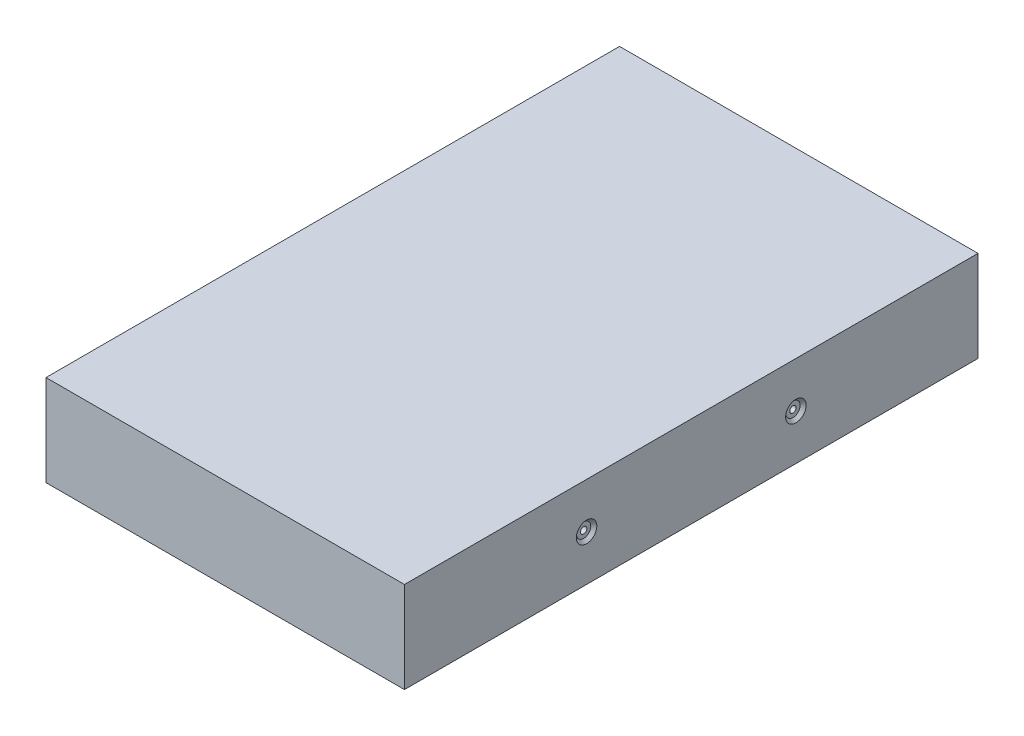
ISO-10303-21;
HEADER;
FILE_DESCRIPTION(('STEP AP214'),'2;1');
FILE_NAME('part.step','',(''),(''),'','','');
FILE_SCHEMA(('AUTOMOTIVE_DESIGN { 1 0 10303 214 1 1 1 1 }'));
ENDSEC;
DATA;
#1=APPLICATION_CONTEXT('core data for automotive mechanical design processes');
#2=APPLICATION_PROTOCOL_DEFINITION('international standard','automotive_design',2000,#1);
#3=PRODUCT_CONTEXT('',#1,'mechanical');
#4=PRODUCT('Part','Part','',(#3));
#5=PRODUCT_RELATED_PRODUCT_CATEGORY('part','',(#4));
#6=PRODUCT_DEFINITION_FORMATION('','',#4);
#7=PRODUCT_DEFINITION_CONTEXT('part definition',#1,'design');
#8=PRODUCT_DEFINITION('design','',#6,#7);
#9=PRODUCT_DEFINITION_SHAPE('','',#8);
#10=(LENGTH_UNIT() NAMED_UNIT(*) SI_UNIT(.MILLI.,.METRE.));
#11=(NAMED_UNIT(*) PLANE_ANGLE_UNIT() SI_UNIT($,.RADIAN.));
#12=(NAMED_UNIT(*) SI_UNIT($,.STERADIAN.) SOLID_ANGLE_UNIT());
#13=UNCERTAINTY_MEASURE_WITH_UNIT(LENGTH_MEASURE(1.E-05),#10,'distance_accuracy_value','');
#14=(GEOMETRIC_REPRESENTATION_CONTEXT(3) GLOBAL_UNCERTAINTY_ASSIGNED_CONTEXT((#13)) GLOBAL_UNIT_ASSIGNED_CONTEXT((#10,
#11,#12)) REPRESENTATION_CONTEXT('',''));
#15=CARTESIAN_POINT('',(0.,0.,0.));
#16=DIRECTION('',(0.,0.,1.));
#17=DIRECTION('',(1.,0.,0.));
#18=AXIS2_PLACEMENT_3D('',#15,#16,#17);
#19=CARTESIAN_POINT('',(50.,25.4,-80.));
#20=DIRECTION('',(-1.,0.,0.));
#21=DIRECTION('',(0.,0.,1.));
#22=AXIS2_PLACEMENT_3D('',#19,#20,#21);
#23=PLANE('',#22);
#24=CARTESIAN_POINT('',(50.,12.7,29.2));
#25=DIRECTION('',(1.,0.,0.));
#26=DIRECTION('',(0.,0.,-1.));
#27=AXIS2_PLACEMENT_3D('',#24,#25,#26);
#28=CIRCLE('',#27,2.8575);
#29=CARTESIAN_POINT('',(50.,12.7,26.3425));
#30=VERTEX_POINT('',#29);
#31=EDGE_CURVE('E163',#30,#30,#28,.T.);
#32=ORIENTED_EDGE('',*,*,#31,.F.);
#33=EDGE_LOOP('',(#32));
#34=FACE_BOUND('',#33,.T.);
#35=CARTESIAN_POINT('',(50.,12.7,-29.2));
#36=DIRECTION('',(1.,0.,0.));
#37=DIRECTION('',(0.,0.,-1.));
#38=AXIS2_PLACEMENT_3D('',#35,#36,#37);
#39=CIRCLE('',#38,2.8575);
#40=CARTESIAN_POINT('',(50.,12.7,-32.0575));
#41=VERTEX_POINT('',#40);
#42=EDGE_CURVE('E97',#41,#41,#39,.T.);
#43=ORIENTED_EDGE('',*,*,#42,.F.);
#44=EDGE_LOOP('',(#43));
#45=FACE_BOUND('',#44,.T.);
#46=DIRECTION('',(0.,0.,-1.));
#47=VECTOR('',#46,1.);
#48=CARTESIAN_POINT('',(50.,0.,-80.));
#49=LINE('',#48,#47);
#50=CARTESIAN_POINT('',(50.,0.,80.));
#51=VERTEX_POINT('',#50);
#52=CARTESIAN_POINT('',(50.,0.,-80.));
#53=VERTEX_POINT('',#52);
#54=EDGE_CURVE('E119',#51,#53,#49,.T.);
#55=ORIENTED_EDGE('',*,*,#54,.T.);
#56=DIRECTION('',(0.,-1.,0.));
#57=VECTOR('',#56,1.);
#58=CARTESIAN_POINT('',(50.,25.4,-80.));
#59=LINE('',#58,#57);
#60=CARTESIAN_POINT('',(50.,25.4,-80.));
#61=VERTEX_POINT('',#60);
#62=EDGE_CURVE('E11',#61,#53,#59,.T.);
#63=ORIENTED_EDGE('',*,*,#62,.F.);
#64=DIRECTION('',(0.,0.,-1.));
#65=VECTOR('',#64,1.);
#66=CARTESIAN_POINT('',(50.,25.4,-80.));
#67=LINE('',#66,#65);
#68=CARTESIAN_POINT('',(50.,25.4,80.));
#69=VERTEX_POINT('',#68);
#70=EDGE_CURVE('E120',#69,#61,#67,.T.);
#71=ORIENTED_EDGE('',*,*,#70,.F.);
#72=DIRECTION('',(0.,-1.,0.));
#73=VECTOR('',#72,1.);
#74=CARTESIAN_POINT('',(50.,25.4,80.));
#75=LINE('',#74,#73);
#76=EDGE_CURVE('E126',#69,#51,#75,.T.);
#77=ORIENTED_EDGE('',*,*,#76,.T.);
#78=EDGE_LOOP('',(#55,#63,#71,#77));
#79=FACE_BOUND('',#78,.T.);
#80=ADVANCED_FACE('F33',(#34,#45,#79),#23,.F.);
#81=CARTESIAN_POINT('',(-50.,25.4,-80.));
#82=DIRECTION('',(0.,0.,1.));
#83=DIRECTION('',(1.,0.,0.));
#84=AXIS2_PLACEMENT_3D('',#81,#82,#83);
#85=PLANE('',#84);
#86=DIRECTION('',(-1.,0.,0.));
#87=VECTOR('',#86,1.);
#88=CARTESIAN_POINT('',(-50.,0.,-80.));
#89=LINE('',#88,#87);
#90=CARTESIAN_POINT('',(-50.,0.,-80.));
#91=VERTEX_POINT('',#90);
#92=EDGE_CURVE('E129',#53,#91,#89,.T.);
#93=ORIENTED_EDGE('',*,*,#92,.T.);
#94=DIRECTION('',(0.,-1.,0.));
#95=VECTOR('',#94,1.);
#96=CARTESIAN_POINT('',(-50.,25.4,-80.));
#97=LINE('',#96,#95);
#98=CARTESIAN_POINT('',(-50.,25.4,-80.));
#99=VERTEX_POINT('',#98);
#100=EDGE_CURVE('E41',#99,#91,#97,.T.);
#101=ORIENTED_EDGE('',*,*,#100,.F.);
#102=DIRECTION('',(-1.,0.,0.));
#103=VECTOR('',#102,1.);
#104=CARTESIAN_POINT('',(-50.,25.4,-80.));
#105=LINE('',#104,#103);
#106=EDGE_CURVE('E80',#61,#99,#105,.T.);
#107=ORIENTED_EDGE('',*,*,#106,.F.);
#108=ORIENTED_EDGE('',*,*,#62,.T.);
#109=EDGE_LOOP('',(#93,#101,#107,#108));
#110=FACE_BOUND('',#109,.T.);
#111=ADVANCED_FACE('F152',(#110),#85,.F.);
#112=CARTESIAN_POINT('',(-50.,25.4,-80.));
#113=DIRECTION('',(1.,0.,0.));
#114=DIRECTION('',(0.,0.,-1.));
#115=AXIS2_PLACEMENT_3D('',#112,#113,#114);
#116=PLANE('',#115);
#117=DIRECTION('',(0.,0.,1.));
#118=VECTOR('',#117,1.);
#119=CARTESIAN_POINT('',(-50.,0.,-80.));
#120=LINE('',#119,#118);
#121=CARTESIAN_POINT('',(-50.,0.,80.));
#122=VERTEX_POINT('',#121);
#123=EDGE_CURVE('E67',#91,#122,#120,.T.);
#124=ORIENTED_EDGE('',*,*,#123,.T.);
#125=DIRECTION('',(0.,-1.,0.));
#126=VECTOR('',#125,1.);
#127=CARTESIAN_POINT('',(-50.,25.4,80.));
#128=LINE('',#127,#126);
#129=CARTESIAN_POINT('',(-50.,25.4,80.));
#130=VERTEX_POINT('',#129);
#131=EDGE_CURVE('E134',#130,#122,#128,.T.);
#132=ORIENTED_EDGE('',*,*,#131,.F.);
#133=DIRECTION('',(0.,0.,1.));
#134=VECTOR('',#133,1.);
#135=CARTESIAN_POINT('',(-50.,25.4,-80.));
#136=LINE('',#135,#134);
#137=EDGE_CURVE('E123',#99,#130,#136,.T.);
#138=ORIENTED_EDGE('',*,*,#137,.F.);
#139=ORIENTED_EDGE('',*,*,#100,.T.);
#140=EDGE_LOOP('',(#124,#132,#138,#139));
#141=FACE_BOUND('',#140,.T.);
#142=ADVANCED_FACE('F136',(#141),#116,.F.);
#143=CARTESIAN_POINT('',(-50.,25.4,80.));
#144=DIRECTION('',(0.,0.,-1.));
#145=DIRECTION('',(-1.,0.,0.));
#146=AXIS2_PLACEMENT_3D('',#143,#144,#145);
#147=PLANE('',#146);
#148=DIRECTION('',(1.,0.,0.));
#149=VECTOR('',#148,1.);
#150=CARTESIAN_POINT('',(-50.,0.,80.));
#151=LINE('',#150,#149);
#152=EDGE_CURVE('E73',#122,#51,#151,.T.);
#153=ORIENTED_EDGE('',*,*,#152,.T.);
#154=ORIENTED_EDGE('',*,*,#76,.F.);
#155=DIRECTION('',(1.,0.,0.));
#156=VECTOR('',#155,1.);
#157=CARTESIAN_POINT('',(-50.,25.4,80.));
#158=LINE('',#157,#156);
#159=EDGE_CURVE('E49',#130,#69,#158,.T.);
#160=ORIENTED_EDGE('',*,*,#159,.F.);
#161=ORIENTED_EDGE('',*,*,#131,.T.);
#162=EDGE_LOOP('',(#153,#154,#160,#161));
#163=FACE_BOUND('',#162,.T.);
#164=ADVANCED_FACE('F143',(#163),#147,.F.);
#165=CARTESIAN_POINT('',(0.,25.4,0.));
#166=DIRECTION('',(0.,1.,0.));
#167=DIRECTION('',(0.,0.,1.));
#168=AXIS2_PLACEMENT_3D('',#165,#166,#167);
#169=PLANE('',#168);
#170=ORIENTED_EDGE('',*,*,#70,.T.);
#171=ORIENTED_EDGE('',*,*,#106,.T.);
#172=ORIENTED_EDGE('',*,*,#137,.T.);
#173=ORIENTED_EDGE('',*,*,#159,.T.);
#174=EDGE_LOOP('',(#170,#171,#172,#173));
#175=FACE_BOUND('',#174,.T.);
#176=ADVANCED_FACE('F145',(#175),#169,.T.);
#177=CARTESIAN_POINT('',(0.,0.,0.));
#178=DIRECTION('',(0.,1.,0.));
#179=DIRECTION('',(0.,0.,1.));
#180=AXIS2_PLACEMENT_3D('',#177,#178,#179);
#181=PLANE('',#180);
#182=ORIENTED_EDGE('',*,*,#54,.F.);
#183=ORIENTED_EDGE('',*,*,#152,.F.);
#184=ORIENTED_EDGE('',*,*,#123,.F.);
#185=ORIENTED_EDGE('',*,*,#92,.F.);
#186=EDGE_LOOP('',(#182,#183,#184,#185));
#187=FACE_BOUND('',#186,.T.);
#188=ADVANCED_FACE('F139',(#187),#181,.F.);
#189=CARTESIAN_POINT('',(20.,12.7,-29.2));
#190=DIRECTION('',(1.,0.,0.));
#191=DIRECTION('',(0.,0.,-1.));
#192=AXIS2_PLACEMENT_3D('',#189,#190,#191);
#193=CONICAL_SURFACE('',#192,0.888999999999992,1.02974425867665);
#194=CARTESIAN_POINT('',(19.4658349096845,12.7,-29.2));
#195=VERTEX_POINT('',#194);
#196=VERTEX_LOOP('',#195);
#197=FACE_BOUND('',#196,.T.);
#198=CARTESIAN_POINT('',(20.,12.7,-29.2));
#199=DIRECTION('',(1.,0.,0.));
#200=DIRECTION('',(0.,0.,-1.));
#201=AXIS2_PLACEMENT_3D('',#198,#199,#200);
#202=CIRCLE('',#201,0.888999999999992);
#203=CARTESIAN_POINT('',(20.,12.7,-30.089));
#204=VERTEX_POINT('',#203);
#205=EDGE_CURVE('E116',#204,#204,#202,.T.);
#206=ORIENTED_EDGE('',*,*,#205,.T.);
#207=EDGE_LOOP('',(#206));
#208=FACE_BOUND('',#207,.T.);
#209=ADVANCED_FACE('F185',(#197,#208),#193,.F.);
#210=CARTESIAN_POINT('',(50.,12.7,-29.2));
#211=DIRECTION('',(1.,0.,0.));
#212=DIRECTION('',(0.,0.,-1.));
#213=AXIS2_PLACEMENT_3D('',#210,#211,#212);
#214=CYLINDRICAL_SURFACE('',#213,0.888999999999994);
#215=ORIENTED_EDGE('',*,*,#205,.F.);
#216=EDGE_LOOP('',(#215));
#217=FACE_BOUND('',#216,.T.);
#218=CARTESIAN_POINT('',(49.1872,12.7,-29.2));
#219=DIRECTION('',(1.,0.,0.));
#220=DIRECTION('',(0.,0.,-1.));
#221=AXIS2_PLACEMENT_3D('',#218,#219,#220);
#222=CIRCLE('',#221,0.888999999999996);
#223=CARTESIAN_POINT('',(49.1872,12.7,-30.089));
#224=VERTEX_POINT('',#223);
#225=EDGE_CURVE('E113',#224,#224,#222,.T.);
#226=ORIENTED_EDGE('',*,*,#225,.T.);
#227=EDGE_LOOP('',(#226));
#228=FACE_BOUND('',#227,.T.);
#229=ADVANCED_FACE('F181',(#217,#228),#214,.F.);
#230=CARTESIAN_POINT('',(49.1872,13.589,-29.2));
#231=DIRECTION('',(-1.,0.,0.));
#232=DIRECTION('',(0.,0.,1.));
#233=AXIS2_PLACEMENT_3D('',#230,#231,#232);
#234=PLANE('',#233);
#235=ORIENTED_EDGE('',*,*,#225,.F.);
#236=EDGE_LOOP('',(#235));
#237=FACE_BOUND('',#236,.T.);
#238=CARTESIAN_POINT('',(49.1872,12.7,-29.2));
#239=DIRECTION('',(1.,0.,0.));
#240=DIRECTION('',(0.,0.,-1.));
#241=AXIS2_PLACEMENT_3D('',#238,#239,#240);
#242=CIRCLE('',#241,1.98501);
#243=CARTESIAN_POINT('',(49.1872,12.7,-31.18501));
#244=VERTEX_POINT('',#243);
#245=EDGE_CURVE('E110',#244,#244,#242,.T.);
#246=ORIENTED_EDGE('',*,*,#245,.T.);
#247=EDGE_LOOP('',(#246));
#248=FACE_BOUND('',#247,.T.);
#249=ADVANCED_FACE('F173',(#237,#248),#234,.F.);
#250=CARTESIAN_POINT('',(50.,12.7,-29.2));
#251=DIRECTION('',(1.,0.,0.));
#252=DIRECTION('',(0.,0.,-1.));
#253=AXIS2_PLACEMENT_3D('',#250,#251,#252);
#254=CYLINDRICAL_SURFACE('',#253,1.98501);
#255=ORIENTED_EDGE('',*,*,#245,.F.);
#256=EDGE_LOOP('',(#255));
#257=FACE_BOUND('',#256,.T.);
#258=CARTESIAN_POINT('',(49.12751,12.7,-29.2));
#259=DIRECTION('',(1.,0.,0.));
#260=DIRECTION('',(0.,0.,-1.));
#261=AXIS2_PLACEMENT_3D('',#258,#259,#260);
#262=CIRCLE('',#261,1.98501);
#263=CARTESIAN_POINT('',(49.12751,12.7,-31.18501));
#264=VERTEX_POINT('',#263);
#265=EDGE_CURVE('E101',#264,#264,#262,.T.);
#266=ORIENTED_EDGE('',*,*,#265,.T.);
#267=EDGE_LOOP('',(#266));
#268=FACE_BOUND('',#267,.T.);
#269=ADVANCED_FACE('F167',(#257,#268),#254,.T.);
#270=CARTESIAN_POINT('',(50.,12.7,-29.2));
#271=DIRECTION('',(1.,0.,0.));
#272=DIRECTION('',(0.,0.,-1.));
#273=AXIS2_PLACEMENT_3D('',#270,#271,#272);
#274=CONICAL_SURFACE('',#273,2.8575,0.785398163397449);
#275=ORIENTED_EDGE('',*,*,#265,.F.);
#276=EDGE_LOOP('',(#275));
#277=FACE_BOUND('',#276,.T.);
#278=ORIENTED_EDGE('',*,*,#42,.T.);
#279=EDGE_LOOP('',(#278));
#280=FACE_BOUND('',#279,.T.);
#281=ADVANCED_FACE('F91',(#277,#280),#274,.F.);
#282=CARTESIAN_POINT('',(20.,12.7,29.2));
#283=DIRECTION('',(1.,0.,0.));
#284=DIRECTION('',(0.,0.,-1.));
#285=AXIS2_PLACEMENT_3D('',#282,#283,#284);
#286=CONICAL_SURFACE('',#285,0.888999999999992,1.02974425867665);
#287=CARTESIAN_POINT('',(19.4658349096845,12.7,29.2));
#288=VERTEX_POINT('',#287);
#289=VERTEX_LOOP('',#288);
#290=FACE_BOUND('',#289,.T.);
#291=CARTESIAN_POINT('',(20.,12.7,29.2));
#292=DIRECTION('',(1.,0.,0.));
#293=DIRECTION('',(0.,0.,-1.));
#294=AXIS2_PLACEMENT_3D('',#291,#292,#293);
#295=CIRCLE('',#294,0.888999999999992);
#296=CARTESIAN_POINT('',(20.,12.7,28.311));
#297=VERTEX_POINT('',#296);
#298=EDGE_CURVE('E95',#297,#297,#295,.T.);
#299=ORIENTED_EDGE('',*,*,#298,.T.);
#300=EDGE_LOOP('',(#299));
#301=FACE_BOUND('',#300,.T.);
#302=ADVANCED_FACE('F87',(#290,#301),#286,.F.);
#303=CARTESIAN_POINT('',(50.,12.7,29.2));
#304=DIRECTION('',(1.,0.,0.));
#305=DIRECTION('',(0.,0.,-1.));
#306=AXIS2_PLACEMENT_3D('',#303,#304,#305);
#307=CYLINDRICAL_SURFACE('',#306,0.888999999999994);
#308=ORIENTED_EDGE('',*,*,#298,.F.);
#309=EDGE_LOOP('',(#308));
#310=FACE_BOUND('',#309,.T.);
#311=CARTESIAN_POINT('',(49.1872,12.7,29.2));
#312=DIRECTION('',(1.,0.,0.));
#313=DIRECTION('',(0.,0.,-1.));
#314=AXIS2_PLACEMENT_3D('',#311,#312,#313);
#315=CIRCLE('',#314,0.888999999999996);
#316=CARTESIAN_POINT('',(49.1872,12.7,28.311));
#317=VERTEX_POINT('',#316);
#318=EDGE_CURVE('E98',#317,#317,#315,.T.);
#319=ORIENTED_EDGE('',*,*,#318,.T.);
#320=EDGE_LOOP('',(#319));
#321=FACE_BOUND('',#320,.T.);
#322=ADVANCED_FACE('F90',(#310,#321),#307,.F.);
#323=CARTESIAN_POINT('',(49.1872,13.589,29.2));
#324=DIRECTION('',(-1.,0.,0.));
#325=DIRECTION('',(0.,0.,1.));
#326=AXIS2_PLACEMENT_3D('',#323,#324,#325);
#327=PLANE('',#326);
#328=ORIENTED_EDGE('',*,*,#318,.F.);
#329=EDGE_LOOP('',(#328));
#330=FACE_BOUND('',#329,.T.);
#331=CARTESIAN_POINT('',(49.1872,12.7,29.2));
#332=DIRECTION('',(1.,0.,0.));
#333=DIRECTION('',(0.,0.,-1.));
#334=AXIS2_PLACEMENT_3D('',#331,#332,#333);
#335=CIRCLE('',#334,1.98501);
#336=CARTESIAN_POINT('',(49.1872,12.7,27.21499));
#337=VERTEX_POINT('',#336);
#338=EDGE_CURVE('E104',#337,#337,#335,.T.);
#339=ORIENTED_EDGE('',*,*,#338,.T.);
#340=EDGE_LOOP('',(#339));
#341=FACE_BOUND('',#340,.T.);
#342=ADVANCED_FACE('F229',(#330,#341),#327,.F.);
#343=CARTESIAN_POINT('',(50.,12.7,29.2));
#344=DIRECTION('',(1.,0.,0.));
#345=DIRECTION('',(0.,0.,-1.));
#346=AXIS2_PLACEMENT_3D('',#343,#344,#345);
#347=CYLINDRICAL_SURFACE('',#346,1.98501);
#348=ORIENTED_EDGE('',*,*,#338,.F.);
#349=EDGE_LOOP('',(#348));
#350=FACE_BOUND('',#349,.T.);
#351=CARTESIAN_POINT('',(49.12751,12.7,29.2));
#352=DIRECTION('',(1.,0.,0.));
#353=DIRECTION('',(0.,0.,-1.));
#354=AXIS2_PLACEMENT_3D('',#351,#352,#353);
#355=CIRCLE('',#354,1.98501);
#356=CARTESIAN_POINT('',(49.12751,12.7,27.21499));
#357=VERTEX_POINT('',#356);
#358=EDGE_CURVE('E264',#357,#357,#355,.T.);
#359=ORIENTED_EDGE('',*,*,#358,.T.);
#360=EDGE_LOOP('',(#359));
#361=FACE_BOUND('',#360,.T.);
#362=ADVANCED_FACE('F237',(#350,#361),#347,.T.);
#363=CARTESIAN_POINT('',(50.,12.7,29.2));
#364=DIRECTION('',(1.,0.,0.));
#365=DIRECTION('',(0.,0.,-1.));
#366=AXIS2_PLACEMENT_3D('',#363,#364,#365);
#367=CONICAL_SURFACE('',#366,2.8575,0.785398163397449);
#368=ORIENTED_EDGE('',*,*,#358,.F.);
#369=EDGE_LOOP('',(#368));
#370=FACE_BOUND('',#369,.T.);
#371=ORIENTED_EDGE('',*,*,#31,.T.);
#372=EDGE_LOOP('',(#371));
#373=FACE_BOUND('',#372,.T.);
#374=ADVANCED_FACE('F247',(#370,#373),#367,.F.);
#375=CLOSED_SHELL('',(#80,#111,#142,#164,#176,#188,#209,#229,#249,#269,#281,#302,#322,#342,#362,#374));
#376=MANIFOLD_SOLID_BREP('B2',#375);
#377=ADVANCED_BREP_SHAPE_REPRESENTATION('',(#18,#376),#14);
#378=SHAPE_DEFINITION_REPRESENTATION(#9,#377);
ENDSEC;
END-ISO-10303-21;
